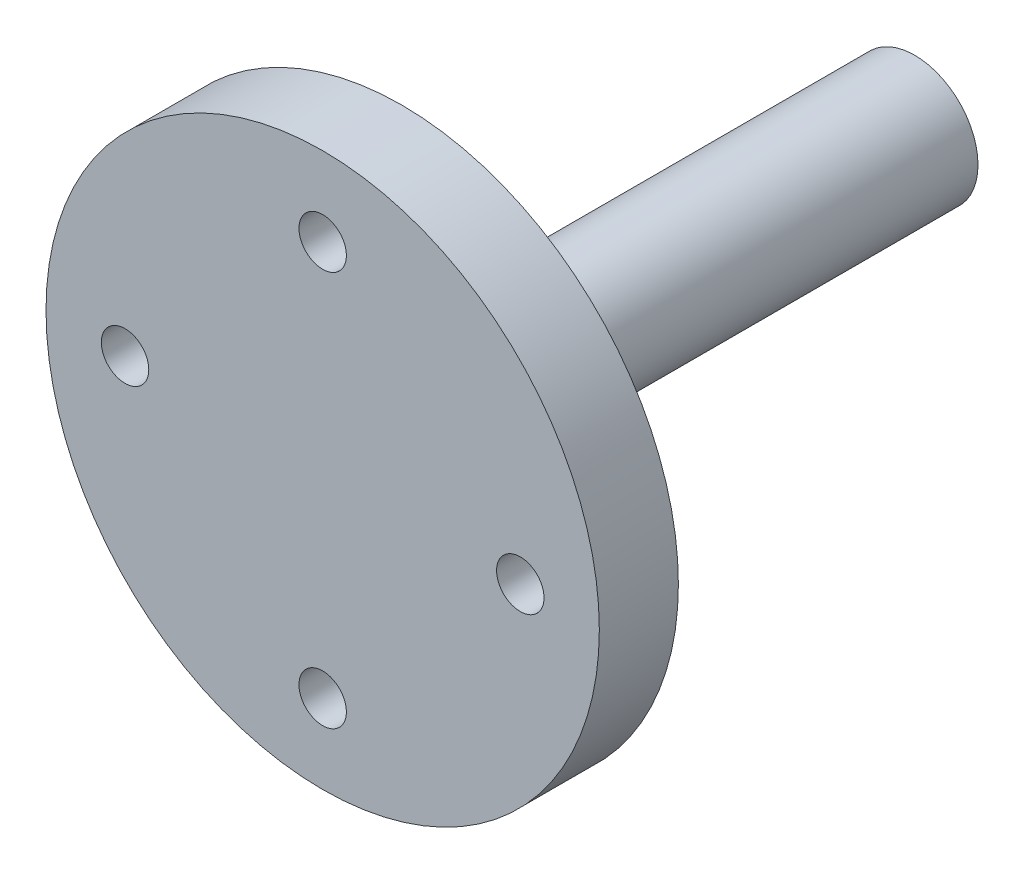
ISO-10303-21;
HEADER;
FILE_DESCRIPTION(('STEP AP214'),'2;1');
FILE_NAME('part.step','',(''),(''),'','','');
FILE_SCHEMA(('AUTOMOTIVE_DESIGN { 1 0 10303 214 1 1 1 1 }'));
ENDSEC;
DATA;
#1=APPLICATION_CONTEXT('core data for automotive mechanical design processes');
#2=APPLICATION_PROTOCOL_DEFINITION('international standard','automotive_design',2000,#1);
#3=PRODUCT_CONTEXT('',#1,'mechanical');
#4=PRODUCT('Part','Part','',(#3));
#5=PRODUCT_RELATED_PRODUCT_CATEGORY('part','',(#4));
#6=PRODUCT_DEFINITION_FORMATION('','',#4);
#7=PRODUCT_DEFINITION_CONTEXT('part definition',#1,'design');
#8=PRODUCT_DEFINITION('design','',#6,#7);
#9=PRODUCT_DEFINITION_SHAPE('','',#8);
#10=(LENGTH_UNIT() NAMED_UNIT(*) SI_UNIT(.MILLI.,.METRE.));
#11=(NAMED_UNIT(*) PLANE_ANGLE_UNIT() SI_UNIT($,.RADIAN.));
#12=(NAMED_UNIT(*) SI_UNIT($,.STERADIAN.) SOLID_ANGLE_UNIT());
#13=UNCERTAINTY_MEASURE_WITH_UNIT(LENGTH_MEASURE(1.E-05),#10,'distance_accuracy_value','');
#14=(GEOMETRIC_REPRESENTATION_CONTEXT(3) GLOBAL_UNCERTAINTY_ASSIGNED_CONTEXT((#13)) GLOBAL_UNIT_ASSIGNED_CONTEXT((#10,
#11,#12)) REPRESENTATION_CONTEXT('',''));
#15=CARTESIAN_POINT('',(0.,0.,0.));
#16=DIRECTION('',(0.,0.,1.));
#17=DIRECTION('',(1.,0.,0.));
#18=AXIS2_PLACEMENT_3D('',#15,#16,#17);
#19=CARTESIAN_POINT('',(0.,0.,12.4510611794986));
#20=DIRECTION('',(0.,0.,-1.));
#21=DIRECTION('',(-1.,0.,0.));
#22=AXIS2_PLACEMENT_3D('',#19,#20,#21);
#23=CYLINDRICAL_SURFACE('',#22,4.);
#24=CARTESIAN_POINT('',(0.,0.,9.45106117949861));
#25=DIRECTION('',(0.,0.,1.));
#26=DIRECTION('',(1.,0.,0.));
#27=AXIS2_PLACEMENT_3D('',#24,#25,#26);
#28=CIRCLE('',#27,4.);
#29=CARTESIAN_POINT('',(4.,0.,9.45106117949861));
#30=VERTEX_POINT('',#29);
#31=EDGE_CURVE('E10',#30,#30,#28,.F.);
#32=ORIENTED_EDGE('',*,*,#31,.T.);
#33=EDGE_LOOP('',(#32));
#34=FACE_BOUND('',#33,.T.);
#35=CARTESIAN_POINT('',(0.,0.,-20.));
#36=DIRECTION('',(0.,0.,1.));
#37=DIRECTION('',(1.,0.,0.));
#38=AXIS2_PLACEMENT_3D('',#35,#36,#37);
#39=CIRCLE('',#38,4.);
#40=CARTESIAN_POINT('',(4.,0.,-20.));
#41=VERTEX_POINT('',#40);
#42=EDGE_CURVE('E48',#41,#41,#39,.T.);
#43=ORIENTED_EDGE('',*,*,#42,.T.);
#44=EDGE_LOOP('',(#43));
#45=FACE_BOUND('',#44,.T.);
#46=ADVANCED_FACE('F37',(#34,#45),#23,.T.);
#47=CARTESIAN_POINT('',(0.,0.,-20.));
#48=DIRECTION('',(0.,0.,1.));
#49=DIRECTION('',(1.,0.,0.));
#50=AXIS2_PLACEMENT_3D('',#47,#48,#49);
#51=PLANE('',#50);
#52=ORIENTED_EDGE('',*,*,#42,.F.);
#53=EDGE_LOOP('',(#52));
#54=FACE_BOUND('',#53,.T.);
#55=ADVANCED_FACE('F91',(#54),#51,.F.);
#56=CARTESIAN_POINT('',(0.,0.,17.4510611794986));
#57=DIRECTION('',(0.,0.,1.));
#58=DIRECTION('',(1.,0.,0.));
#59=AXIS2_PLACEMENT_3D('',#56,#57,#58);
#60=PLANE('',#59);
#61=CARTESIAN_POINT('',(3.50678942383248E-13,-12.5,17.4510611794986));
#62=DIRECTION('',(0.,0.,1.));
#63=DIRECTION('',(1.,0.,0.));
#64=AXIS2_PLACEMENT_3D('',#61,#62,#63);
#65=CIRCLE('',#64,1.50000000000042);
#66=CARTESIAN_POINT('',(1.50000000000077,-12.5,17.4510611794986));
#67=VERTEX_POINT('',#66);
#68=EDGE_CURVE('E70',#67,#67,#65,.T.);
#69=ORIENTED_EDGE('',*,*,#68,.F.);
#70=EDGE_LOOP('',(#69));
#71=FACE_BOUND('',#70,.T.);
#72=CARTESIAN_POINT('',(0.,12.5,17.4510611794986));
#73=DIRECTION('',(0.,0.,1.));
#74=DIRECTION('',(1.,0.,0.));
#75=AXIS2_PLACEMENT_3D('',#72,#73,#74);
#76=CIRCLE('',#75,1.5);
#77=CARTESIAN_POINT('',(1.5,12.5,17.4510611794986));
#78=VERTEX_POINT('',#77);
#79=EDGE_CURVE('E58',#78,#78,#76,.T.);
#80=ORIENTED_EDGE('',*,*,#79,.F.);
#81=EDGE_LOOP('',(#80));
#82=FACE_BOUND('',#81,.T.);
#83=CARTESIAN_POINT('',(0.,0.,17.4510611794986));
#84=DIRECTION('',(0.,0.,1.));
#85=DIRECTION('',(1.,0.,0.));
#86=AXIS2_PLACEMENT_3D('',#83,#84,#85);
#87=CIRCLE('',#86,17.5);
#88=CARTESIAN_POINT('',(17.5,0.,17.4510611794986));
#89=VERTEX_POINT('',#88);
#90=EDGE_CURVE('E52',#89,#89,#87,.T.);
#91=ORIENTED_EDGE('',*,*,#90,.T.);
#92=EDGE_LOOP('',(#91));
#93=FACE_BOUND('',#92,.T.);
#94=CARTESIAN_POINT('',(12.5,0.,17.4510611794986));
#95=DIRECTION('',(0.,0.,1.));
#96=DIRECTION('',(1.,0.,0.));
#97=AXIS2_PLACEMENT_3D('',#94,#95,#96);
#98=CIRCLE('',#97,1.5);
#99=CARTESIAN_POINT('',(14.,0.,17.4510611794986));
#100=VERTEX_POINT('',#99);
#101=EDGE_CURVE('E64',#100,#100,#98,.T.);
#102=ORIENTED_EDGE('',*,*,#101,.F.);
#103=EDGE_LOOP('',(#102));
#104=FACE_BOUND('',#103,.T.);
#105=CARTESIAN_POINT('',(-12.5,1.30930550206618E-13,17.4510611794986));
#106=DIRECTION('',(0.,0.,1.));
#107=DIRECTION('',(1.,0.,0.));
#108=AXIS2_PLACEMENT_3D('',#105,#106,#107);
#109=CIRCLE('',#108,1.5);
#110=CARTESIAN_POINT('',(-11.,1.30930550206618E-13,17.4510611794986));
#111=VERTEX_POINT('',#110);
#112=EDGE_CURVE('E76',#111,#111,#109,.T.);
#113=ORIENTED_EDGE('',*,*,#112,.F.);
#114=EDGE_LOOP('',(#113));
#115=FACE_BOUND('',#114,.T.);
#116=ADVANCED_FACE('F88',(#71,#82,#93,#104,#115),#60,.T.);
#117=CARTESIAN_POINT('',(0.,0.,12.4510611794986));
#118=DIRECTION('',(0.,0.,1.));
#119=DIRECTION('',(1.,0.,0.));
#120=AXIS2_PLACEMENT_3D('',#117,#118,#119);
#121=PLANE('',#120);
#122=CARTESIAN_POINT('',(0.,0.,12.4510611794986));
#123=DIRECTION('',(0.,0.,1.));
#124=DIRECTION('',(1.,0.,0.));
#125=AXIS2_PLACEMENT_3D('',#122,#123,#124);
#126=CIRCLE('',#125,7.);
#127=CARTESIAN_POINT('',(7.,0.,12.4510611794986));
#128=VERTEX_POINT('',#127);
#129=EDGE_CURVE('E44',#128,#128,#126,.T.);
#130=ORIENTED_EDGE('',*,*,#129,.T.);
#131=EDGE_LOOP('',(#130));
#132=FACE_BOUND('',#131,.T.);
#133=CARTESIAN_POINT('',(0.,0.,12.4510611794986));
#134=DIRECTION('',(0.,0.,1.));
#135=DIRECTION('',(1.,0.,0.));
#136=AXIS2_PLACEMENT_3D('',#133,#134,#135);
#137=CIRCLE('',#136,17.5);
#138=CARTESIAN_POINT('',(17.5,0.,12.4510611794986));
#139=VERTEX_POINT('',#138);
#140=EDGE_CURVE('E55',#139,#139,#137,.T.);
#141=ORIENTED_EDGE('',*,*,#140,.F.);
#142=EDGE_LOOP('',(#141));
#143=FACE_BOUND('',#142,.T.);
#144=CARTESIAN_POINT('',(0.,12.5,12.4510611794986));
#145=DIRECTION('',(0.,0.,1.));
#146=DIRECTION('',(1.,0.,0.));
#147=AXIS2_PLACEMENT_3D('',#144,#145,#146);
#148=CIRCLE('',#147,1.5);
#149=CARTESIAN_POINT('',(1.5,12.5,12.4510611794986));
#150=VERTEX_POINT('',#149);
#151=EDGE_CURVE('E61',#150,#150,#148,.T.);
#152=ORIENTED_EDGE('',*,*,#151,.T.);
#153=EDGE_LOOP('',(#152));
#154=FACE_BOUND('',#153,.T.);
#155=CARTESIAN_POINT('',(12.5,0.,12.4510611794986));
#156=DIRECTION('',(0.,0.,1.));
#157=DIRECTION('',(1.,0.,0.));
#158=AXIS2_PLACEMENT_3D('',#155,#156,#157);
#159=CIRCLE('',#158,1.5);
#160=CARTESIAN_POINT('',(14.,0.,12.4510611794986));
#161=VERTEX_POINT('',#160);
#162=EDGE_CURVE('E67',#161,#161,#159,.T.);
#163=ORIENTED_EDGE('',*,*,#162,.T.);
#164=EDGE_LOOP('',(#163));
#165=FACE_BOUND('',#164,.T.);
#166=CARTESIAN_POINT('',(3.50678942383248E-13,-12.5,12.4510611794986));
#167=DIRECTION('',(0.,0.,1.));
#168=DIRECTION('',(1.,0.,0.));
#169=AXIS2_PLACEMENT_3D('',#166,#167,#168);
#170=CIRCLE('',#169,1.50000000000042);
#171=CARTESIAN_POINT('',(1.50000000000077,-12.5,12.4510611794986));
#172=VERTEX_POINT('',#171);
#173=EDGE_CURVE('E73',#172,#172,#170,.T.);
#174=ORIENTED_EDGE('',*,*,#173,.T.);
#175=EDGE_LOOP('',(#174));
#176=FACE_BOUND('',#175,.T.);
#177=CARTESIAN_POINT('',(-12.5,1.30930550206618E-13,12.4510611794986));
#178=DIRECTION('',(0.,0.,1.));
#179=DIRECTION('',(1.,0.,0.));
#180=AXIS2_PLACEMENT_3D('',#177,#178,#179);
#181=CIRCLE('',#180,1.5);
#182=CARTESIAN_POINT('',(-11.,1.30930550206618E-13,12.4510611794986));
#183=VERTEX_POINT('',#182);
#184=EDGE_CURVE('E79',#183,#183,#181,.T.);
#185=ORIENTED_EDGE('',*,*,#184,.T.);
#186=EDGE_LOOP('',(#185));
#187=FACE_BOUND('',#186,.T.);
#188=ADVANCED_FACE('F90',(#132,#143,#154,#165,#176,#187),#121,.F.);
#189=CARTESIAN_POINT('',(0.,0.,17.4510611794986));
#190=DIRECTION('',(0.,0.,-1.));
#191=DIRECTION('',(-1.,0.,0.));
#192=AXIS2_PLACEMENT_3D('',#189,#190,#191);
#193=CYLINDRICAL_SURFACE('',#192,17.5);
#194=ORIENTED_EDGE('',*,*,#90,.F.);
#195=EDGE_LOOP('',(#194));
#196=FACE_BOUND('',#195,.T.);
#197=ORIENTED_EDGE('',*,*,#140,.T.);
#198=EDGE_LOOP('',(#197));
#199=FACE_BOUND('',#198,.T.);
#200=ADVANCED_FACE('F98',(#196,#199),#193,.T.);
#201=CARTESIAN_POINT('',(0.,12.5,17.4510611794986));
#202=DIRECTION('',(0.,0.,-1.));
#203=DIRECTION('',(-1.,0.,0.));
#204=AXIS2_PLACEMENT_3D('',#201,#202,#203);
#205=CYLINDRICAL_SURFACE('',#204,1.5);
#206=ORIENTED_EDGE('',*,*,#79,.T.);
#207=EDGE_LOOP('',(#206));
#208=FACE_BOUND('',#207,.T.);
#209=ORIENTED_EDGE('',*,*,#151,.F.);
#210=EDGE_LOOP('',(#209));
#211=FACE_BOUND('',#210,.T.);
#212=ADVANCED_FACE('F111',(#208,#211),#205,.F.);
#213=CARTESIAN_POINT('',(12.5,0.,17.4510611794986));
#214=DIRECTION('',(0.,0.,-1.));
#215=DIRECTION('',(-1.,0.,0.));
#216=AXIS2_PLACEMENT_3D('',#213,#214,#215);
#217=CYLINDRICAL_SURFACE('',#216,1.5);
#218=ORIENTED_EDGE('',*,*,#101,.T.);
#219=EDGE_LOOP('',(#218));
#220=FACE_BOUND('',#219,.T.);
#221=ORIENTED_EDGE('',*,*,#162,.F.);
#222=EDGE_LOOP('',(#221));
#223=FACE_BOUND('',#222,.T.);
#224=ADVANCED_FACE('F116',(#220,#223),#217,.F.);
#225=CARTESIAN_POINT('',(3.50678942383248E-13,-12.5,17.4510611794986));
#226=DIRECTION('',(0.,0.,-1.));
#227=DIRECTION('',(-1.,0.,0.));
#228=AXIS2_PLACEMENT_3D('',#225,#226,#227);
#229=CYLINDRICAL_SURFACE('',#228,1.50000000000042);
#230=ORIENTED_EDGE('',*,*,#68,.T.);
#231=EDGE_LOOP('',(#230));
#232=FACE_BOUND('',#231,.T.);
#233=ORIENTED_EDGE('',*,*,#173,.F.);
#234=EDGE_LOOP('',(#233));
#235=FACE_BOUND('',#234,.T.);
#236=ADVANCED_FACE('F131',(#232,#235),#229,.F.);
#237=CARTESIAN_POINT('',(-12.5,1.30930550206618E-13,17.4510611794986));
#238=DIRECTION('',(0.,0.,-1.));
#239=DIRECTION('',(-1.,0.,0.));
#240=AXIS2_PLACEMENT_3D('',#237,#238,#239);
#241=CYLINDRICAL_SURFACE('',#240,1.5);
#242=ORIENTED_EDGE('',*,*,#112,.T.);
#243=EDGE_LOOP('',(#242));
#244=FACE_BOUND('',#243,.T.);
#245=ORIENTED_EDGE('',*,*,#184,.F.);
#246=EDGE_LOOP('',(#245));
#247=FACE_BOUND('',#246,.T.);
#248=ADVANCED_FACE('F85',(#244,#247),#241,.F.);
#249=CARTESIAN_POINT('',(0.,0.,9.45106117949861));
#250=DIRECTION('',(0.,0.,1.));
#251=DIRECTION('',(1.,0.,0.));
#252=AXIS2_PLACEMENT_3D('',#249,#250,#251);
#253=TOROIDAL_SURFACE('',#252,7.,3.);
#254=ORIENTED_EDGE('',*,*,#31,.F.);
#255=EDGE_LOOP('',(#254));
#256=FACE_BOUND('',#255,.T.);
#257=ORIENTED_EDGE('',*,*,#129,.F.);
#258=EDGE_LOOP('',(#257));
#259=FACE_BOUND('',#258,.T.);
#260=ADVANCED_FACE('F39',(#256,#259),#253,.F.);
#261=CLOSED_SHELL('',(#46,#55,#116,#188,#200,#212,#224,#236,#248,#260));
#262=MANIFOLD_SOLID_BREP('B2',#261);
#263=ADVANCED_BREP_SHAPE_REPRESENTATION('',(#18,#262),#14);
#264=SHAPE_DEFINITION_REPRESENTATION(#9,#263);
ENDSEC;
END-ISO-10303-21;
